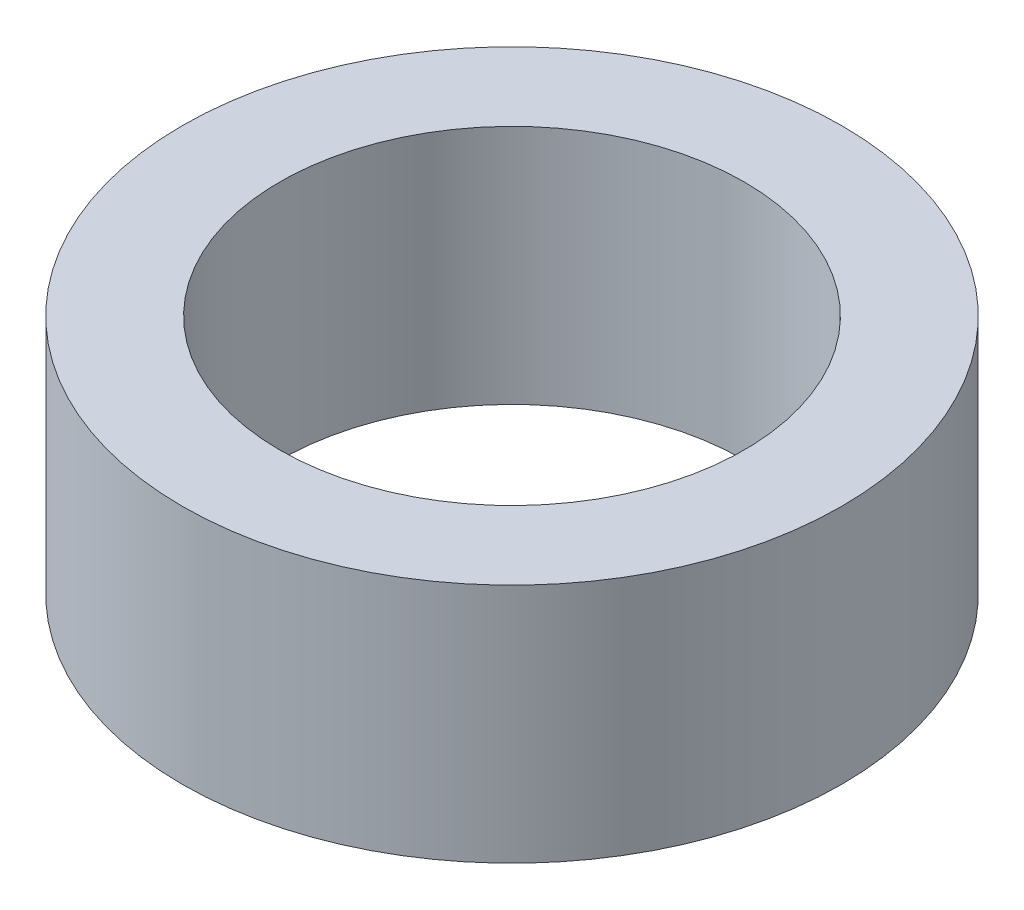
ISO-10303-21;
HEADER;
FILE_DESCRIPTION(('STEP AP214'),'2;1');
FILE_NAME('part.step','',(''),(''),'','','');
FILE_SCHEMA(('AUTOMOTIVE_DESIGN { 1 0 10303 214 1 1 1 1 }'));
ENDSEC;
DATA;
#1=APPLICATION_CONTEXT('core data for automotive mechanical design processes');
#2=APPLICATION_PROTOCOL_DEFINITION('international standard','automotive_design',2000,#1);
#3=PRODUCT_CONTEXT('',#1,'mechanical');
#4=PRODUCT('Part','Part','',(#3));
#5=PRODUCT_RELATED_PRODUCT_CATEGORY('part','',(#4));
#6=PRODUCT_DEFINITION_FORMATION('','',#4);
#7=PRODUCT_DEFINITION_CONTEXT('part definition',#1,'design');
#8=PRODUCT_DEFINITION('design','',#6,#7);
#9=PRODUCT_DEFINITION_SHAPE('','',#8);
#10=(LENGTH_UNIT() NAMED_UNIT(*) SI_UNIT(.MILLI.,.METRE.));
#11=(NAMED_UNIT(*) PLANE_ANGLE_UNIT() SI_UNIT($,.RADIAN.));
#12=(NAMED_UNIT(*) SI_UNIT($,.STERADIAN.) SOLID_ANGLE_UNIT());
#13=UNCERTAINTY_MEASURE_WITH_UNIT(LENGTH_MEASURE(1.E-05),#10,'distance_accuracy_value','');
#14=(GEOMETRIC_REPRESENTATION_CONTEXT(3) GLOBAL_UNCERTAINTY_ASSIGNED_CONTEXT((#13)) GLOBAL_UNIT_ASSIGNED_CONTEXT((#10,
#11,#12)) REPRESENTATION_CONTEXT('',''));
#15=CARTESIAN_POINT('',(0.,0.,0.));
#16=DIRECTION('',(0.,0.,1.));
#17=DIRECTION('',(1.,0.,0.));
#18=AXIS2_PLACEMENT_3D('',#15,#16,#17);
#19=CARTESIAN_POINT('',(0.,42.,0.));
#20=DIRECTION('',(0.,1.,0.));
#21=DIRECTION('',(0.,0.,1.));
#22=AXIS2_PLACEMENT_3D('',#19,#20,#21);
#23=PLANE('',#22);
#24=CARTESIAN_POINT('',(0.,42.,0.));
#25=DIRECTION('',(0.,1.,0.));
#26=DIRECTION('',(0.,0.,1.));
#27=AXIS2_PLACEMENT_3D('',#24,#25,#26);
#28=CIRCLE('',#27,57.5);
#29=CARTESIAN_POINT('',(0.,42.,57.5));
#30=VERTEX_POINT('',#29);
#31=EDGE_CURVE('E10',#30,#30,#28,.T.);
#32=ORIENTED_EDGE('',*,*,#31,.T.);
#33=EDGE_LOOP('',(#32));
#34=FACE_BOUND('',#33,.T.);
#35=CARTESIAN_POINT('',(0.,42.,0.));
#36=DIRECTION('',(0.,1.,0.));
#37=DIRECTION('',(0.,0.,1.));
#38=AXIS2_PLACEMENT_3D('',#35,#36,#37);
#39=CIRCLE('',#38,40.5);
#40=CARTESIAN_POINT('',(0.,42.,40.5));
#41=VERTEX_POINT('',#40);
#42=EDGE_CURVE('E52',#41,#41,#39,.T.);
#43=ORIENTED_EDGE('',*,*,#42,.F.);
#44=EDGE_LOOP('',(#43));
#45=FACE_BOUND('',#44,.T.);
#46=ADVANCED_FACE('F39',(#34,#45),#23,.T.);
#47=CARTESIAN_POINT('',(0.,0.,0.));
#48=DIRECTION('',(0.,1.,0.));
#49=DIRECTION('',(0.,0.,1.));
#50=AXIS2_PLACEMENT_3D('',#47,#48,#49);
#51=PLANE('',#50);
#52=CARTESIAN_POINT('',(0.,0.,0.));
#53=DIRECTION('',(0.,1.,0.));
#54=DIRECTION('',(0.,0.,1.));
#55=AXIS2_PLACEMENT_3D('',#52,#53,#54);
#56=CIRCLE('',#55,57.5);
#57=CARTESIAN_POINT('',(0.,0.,57.5));
#58=VERTEX_POINT('',#57);
#59=EDGE_CURVE('E43',#58,#58,#56,.T.);
#60=ORIENTED_EDGE('',*,*,#59,.F.);
#61=EDGE_LOOP('',(#60));
#62=FACE_BOUND('',#61,.T.);
#63=CARTESIAN_POINT('',(0.,0.,0.));
#64=DIRECTION('',(0.,1.,0.));
#65=DIRECTION('',(0.,0.,1.));
#66=AXIS2_PLACEMENT_3D('',#63,#64,#65);
#67=CIRCLE('',#66,40.5);
#68=CARTESIAN_POINT('',(0.,0.,40.5));
#69=VERTEX_POINT('',#68);
#70=EDGE_CURVE('E54',#69,#69,#67,.T.);
#71=ORIENTED_EDGE('',*,*,#70,.T.);
#72=EDGE_LOOP('',(#71));
#73=FACE_BOUND('',#72,.T.);
#74=ADVANCED_FACE('F66',(#62,#73),#51,.F.);
#75=CARTESIAN_POINT('',(0.,42.,0.));
#76=DIRECTION('',(0.,-1.,0.));
#77=DIRECTION('',(0.,0.,-1.));
#78=AXIS2_PLACEMENT_3D('',#75,#76,#77);
#79=CYLINDRICAL_SURFACE('',#78,57.5);
#80=ORIENTED_EDGE('',*,*,#31,.F.);
#81=EDGE_LOOP('',(#80));
#82=FACE_BOUND('',#81,.T.);
#83=ORIENTED_EDGE('',*,*,#59,.T.);
#84=EDGE_LOOP('',(#83));
#85=FACE_BOUND('',#84,.T.);
#86=ADVANCED_FACE('F41',(#82,#85),#79,.T.);
#87=CARTESIAN_POINT('',(0.,42.,0.));
#88=DIRECTION('',(0.,-1.,0.));
#89=DIRECTION('',(0.,0.,-1.));
#90=AXIS2_PLACEMENT_3D('',#87,#88,#89);
#91=CYLINDRICAL_SURFACE('',#90,40.5);
#92=ORIENTED_EDGE('',*,*,#42,.T.);
#93=EDGE_LOOP('',(#92));
#94=FACE_BOUND('',#93,.T.);
#95=ORIENTED_EDGE('',*,*,#70,.F.);
#96=EDGE_LOOP('',(#95));
#97=FACE_BOUND('',#96,.T.);
#98=ADVANCED_FACE('F62',(#94,#97),#91,.F.);
#99=CLOSED_SHELL('',(#46,#74,#86,#98));
#100=MANIFOLD_SOLID_BREP('B2',#99);
#101=ADVANCED_BREP_SHAPE_REPRESENTATION('',(#18,#100),#14);
#102=SHAPE_DEFINITION_REPRESENTATION(#9,#101);
ENDSEC;
END-ISO-10303-21;
